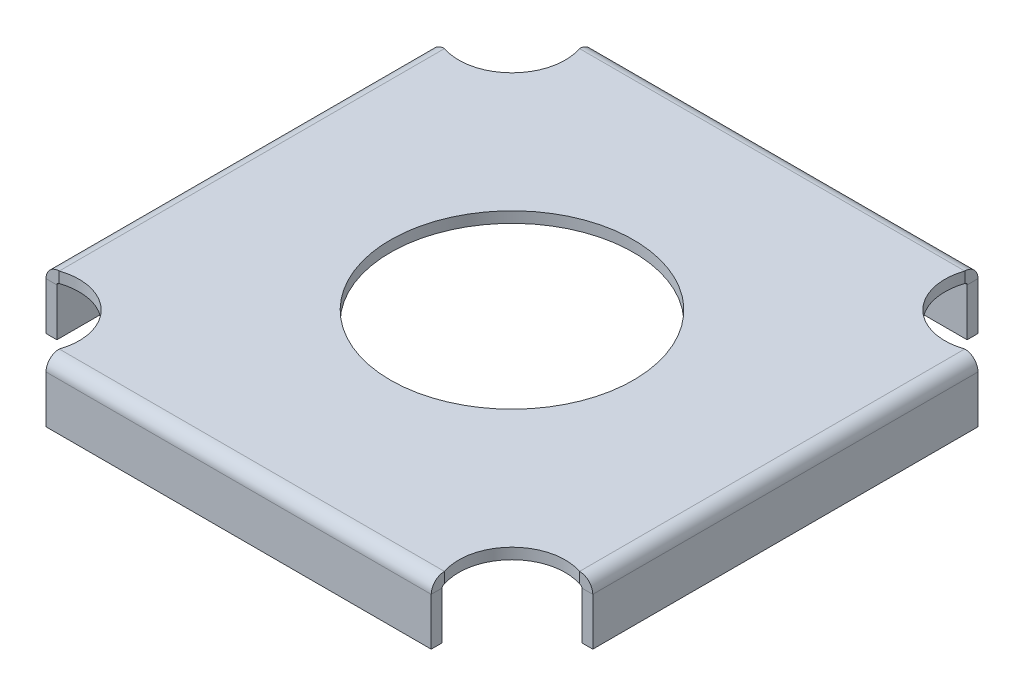
ISO-10303-21;
HEADER;
FILE_DESCRIPTION(('STEP AP214'),'2;1');
FILE_NAME('part.step','',(''),(''),'','','');
FILE_SCHEMA(('AUTOMOTIVE_DESIGN { 1 0 10303 214 1 1 1 1 }'));
ENDSEC;
DATA;
#1=APPLICATION_CONTEXT('core data for automotive mechanical design processes');
#2=APPLICATION_PROTOCOL_DEFINITION('international standard','automotive_design',2000,#1);
#3=PRODUCT_CONTEXT('',#1,'mechanical');
#4=PRODUCT('Part','Part','',(#3));
#5=PRODUCT_RELATED_PRODUCT_CATEGORY('part','',(#4));
#6=PRODUCT_DEFINITION_FORMATION('','',#4);
#7=PRODUCT_DEFINITION_CONTEXT('part definition',#1,'design');
#8=PRODUCT_DEFINITION('design','',#6,#7);
#9=PRODUCT_DEFINITION_SHAPE('','',#8);
#10=(LENGTH_UNIT() NAMED_UNIT(*) SI_UNIT(.MILLI.,.METRE.));
#11=(NAMED_UNIT(*) PLANE_ANGLE_UNIT() SI_UNIT($,.RADIAN.));
#12=(NAMED_UNIT(*) SI_UNIT($,.STERADIAN.) SOLID_ANGLE_UNIT());
#13=UNCERTAINTY_MEASURE_WITH_UNIT(LENGTH_MEASURE(1.E-05),#10,'distance_accuracy_value','');
#14=(GEOMETRIC_REPRESENTATION_CONTEXT(3) GLOBAL_UNCERTAINTY_ASSIGNED_CONTEXT((#13)) GLOBAL_UNIT_ASSIGNED_CONTEXT((#10,
#11,#12)) REPRESENTATION_CONTEXT('',''));
#15=CARTESIAN_POINT('',(0.,0.,0.));
#16=DIRECTION('',(0.,0.,1.));
#17=DIRECTION('',(1.,0.,0.));
#18=AXIS2_PLACEMENT_3D('',#15,#16,#17);
#19=CARTESIAN_POINT('',(76.2,-3.4163,76.2));
#20=DIRECTION('',(0.,1.,0.));
#21=DIRECTION('',(0.,0.,1.));
#22=AXIS2_PLACEMENT_3D('',#19,#20,#21);
#23=CYLINDRICAL_SURFACE('',#22,16.7005);
#24=CARTESIAN_POINT('',(76.2,0.,76.2));
#25=DIRECTION('',(0.,-1.,0.));
#26=DIRECTION('',(0.,0.,1.));
#27=AXIS2_PLACEMENT_3D('',#24,#25,#26);
#28=CIRCLE('',#27,16.7005);
#29=CARTESIAN_POINT('',(60.3828089759907,0.,81.5594));
#30=VERTEX_POINT('',#29);
#31=CARTESIAN_POINT('',(81.5594,0.,60.3828089759907));
#32=VERTEX_POINT('',#31);
#33=EDGE_CURVE('E469',#30,#32,#28,.T.);
#34=ORIENTED_EDGE('',*,*,#33,.F.);
#35=DIRECTION('',(0.,1.,0.));
#36=VECTOR('',#35,1.);
#37=CARTESIAN_POINT('',(60.3828089759907,-3.4163,81.5594));
#38=LINE('',#37,#36);
#39=CARTESIAN_POINT('',(60.3828089759907,-3.41629999999999,81.5594));
#40=VERTEX_POINT('',#39);
#41=EDGE_CURVE('E13',#40,#30,#38,.T.);
#42=ORIENTED_EDGE('',*,*,#41,.F.);
#43=CARTESIAN_POINT('',(76.2,-3.4163,76.2));
#44=DIRECTION('',(0.,-1.,0.));
#45=DIRECTION('',(0.,0.,1.));
#46=AXIS2_PLACEMENT_3D('',#43,#44,#45);
#47=CIRCLE('',#46,16.7005);
#48=CARTESIAN_POINT('',(81.5594,-3.4163,60.3828089759907));
#49=VERTEX_POINT('',#48);
#50=EDGE_CURVE('E472',#40,#49,#47,.T.);
#51=ORIENTED_EDGE('',*,*,#50,.T.);
#52=DIRECTION('',(0.,1.,0.));
#53=VECTOR('',#52,1.);
#54=CARTESIAN_POINT('',(81.5594,-3.4163,60.3828089759907));
#55=LINE('',#54,#53);
#56=EDGE_CURVE('E126',#49,#32,#55,.T.);
#57=ORIENTED_EDGE('',*,*,#56,.T.);
#58=EDGE_LOOP('',(#34,#42,#51,#57));
#59=FACE_BOUND('',#58,.T.);
#60=ADVANCED_FACE('F123',(#59),#23,.F.);
#61=CARTESIAN_POINT('',(-76.2,-3.4163,76.2));
#62=DIRECTION('',(0.,1.,0.));
#63=DIRECTION('',(0.,0.,1.));
#64=AXIS2_PLACEMENT_3D('',#61,#62,#63);
#65=CYLINDRICAL_SURFACE('',#64,16.7005);
#66=CARTESIAN_POINT('',(-76.2,0.,76.2));
#67=DIRECTION('',(0.,-1.,0.));
#68=DIRECTION('',(0.,0.,1.));
#69=AXIS2_PLACEMENT_3D('',#66,#67,#68);
#70=CIRCLE('',#69,16.7005);
#71=CARTESIAN_POINT('',(-81.5594,0.,60.3828089759907));
#72=VERTEX_POINT('',#71);
#73=CARTESIAN_POINT('',(-60.3828089759907,0.,81.5594));
#74=VERTEX_POINT('',#73);
#75=EDGE_CURVE('E510',#72,#74,#70,.T.);
#76=ORIENTED_EDGE('',*,*,#75,.F.);
#77=DIRECTION('',(0.,1.,0.));
#78=VECTOR('',#77,1.);
#79=CARTESIAN_POINT('',(-81.5594,-3.4163,60.3828089759907));
#80=LINE('',#79,#78);
#81=CARTESIAN_POINT('',(-81.5594,-3.4163,60.3828089759907));
#82=VERTEX_POINT('',#81);
#83=EDGE_CURVE('E517',#82,#72,#80,.T.);
#84=ORIENTED_EDGE('',*,*,#83,.F.);
#85=CARTESIAN_POINT('',(-76.2,-3.4163,76.2));
#86=DIRECTION('',(0.,-1.,0.));
#87=DIRECTION('',(0.,0.,1.));
#88=AXIS2_PLACEMENT_3D('',#85,#86,#87);
#89=CIRCLE('',#88,16.7005);
#90=CARTESIAN_POINT('',(-60.3828089759907,-3.41629999999999,81.5594));
#91=VERTEX_POINT('',#90);
#92=EDGE_CURVE('E488',#82,#91,#89,.T.);
#93=ORIENTED_EDGE('',*,*,#92,.T.);
#94=DIRECTION('',(0.,1.,0.));
#95=VECTOR('',#94,1.);
#96=CARTESIAN_POINT('',(-60.3828089759907,-3.4163,81.5594));
#97=LINE('',#96,#95);
#98=EDGE_CURVE('E131',#91,#74,#97,.T.);
#99=ORIENTED_EDGE('',*,*,#98,.T.);
#100=EDGE_LOOP('',(#76,#84,#93,#99));
#101=FACE_BOUND('',#100,.T.);
#102=ADVANCED_FACE('F549',(#101),#65,.F.);
#103=CARTESIAN_POINT('',(-76.2,-3.4163,-76.2));
#104=DIRECTION('',(0.,1.,0.));
#105=DIRECTION('',(0.,0.,1.));
#106=AXIS2_PLACEMENT_3D('',#103,#104,#105);
#107=CYLINDRICAL_SURFACE('',#106,16.7005);
#108=CARTESIAN_POINT('',(-76.2,0.,-76.2));
#109=DIRECTION('',(0.,-1.,0.));
#110=DIRECTION('',(0.,0.,1.));
#111=AXIS2_PLACEMENT_3D('',#108,#109,#110);
#112=CIRCLE('',#111,16.7005);
#113=CARTESIAN_POINT('',(-60.3828089759907,0.,-81.5594));
#114=VERTEX_POINT('',#113);
#115=CARTESIAN_POINT('',(-81.5594,0.,-60.3828089759907));
#116=VERTEX_POINT('',#115);
#117=EDGE_CURVE('E504',#114,#116,#112,.T.);
#118=ORIENTED_EDGE('',*,*,#117,.F.);
#119=DIRECTION('',(0.,1.,0.));
#120=VECTOR('',#119,1.);
#121=CARTESIAN_POINT('',(-60.3828089759907,-3.4163,-81.5594));
#122=LINE('',#121,#120);
#123=CARTESIAN_POINT('',(-60.3828089759907,-3.4163,-81.5594));
#124=VERTEX_POINT('',#123);
#125=EDGE_CURVE('E522',#124,#114,#122,.T.);
#126=ORIENTED_EDGE('',*,*,#125,.F.);
#127=CARTESIAN_POINT('',(-76.2,-3.4163,-76.2));
#128=DIRECTION('',(0.,-1.,0.));
#129=DIRECTION('',(0.,0.,1.));
#130=AXIS2_PLACEMENT_3D('',#127,#128,#129);
#131=CIRCLE('',#130,16.7005);
#132=CARTESIAN_POINT('',(-81.5594,-3.4163,-60.3828089759907));
#133=VERTEX_POINT('',#132);
#134=EDGE_CURVE('E483',#124,#133,#131,.T.);
#135=ORIENTED_EDGE('',*,*,#134,.T.);
#136=DIRECTION('',(0.,1.,0.));
#137=VECTOR('',#136,1.);
#138=CARTESIAN_POINT('',(-81.5594,-3.4163,-60.3828089759907));
#139=LINE('',#138,#137);
#140=EDGE_CURVE('E519',#133,#116,#139,.T.);
#141=ORIENTED_EDGE('',*,*,#140,.T.);
#142=EDGE_LOOP('',(#118,#126,#135,#141));
#143=FACE_BOUND('',#142,.T.);
#144=ADVANCED_FACE('F595',(#143),#107,.F.);
#145=CARTESIAN_POINT('',(76.2,-3.4163,-76.2));
#146=DIRECTION('',(0.,1.,0.));
#147=DIRECTION('',(0.,0.,1.));
#148=AXIS2_PLACEMENT_3D('',#145,#146,#147);
#149=CYLINDRICAL_SURFACE('',#148,16.7005);
#150=CARTESIAN_POINT('',(76.2,0.,-76.2));
#151=DIRECTION('',(0.,-1.,0.));
#152=DIRECTION('',(0.,0.,1.));
#153=AXIS2_PLACEMENT_3D('',#150,#151,#152);
#154=CIRCLE('',#153,16.7005);
#155=CARTESIAN_POINT('',(81.5594,0.,-60.3828089759907));
#156=VERTEX_POINT('',#155);
#157=CARTESIAN_POINT('',(60.3828089759907,0.,-81.5594));
#158=VERTEX_POINT('',#157);
#159=EDGE_CURVE('E498',#156,#158,#154,.T.);
#160=ORIENTED_EDGE('',*,*,#159,.F.);
#161=DIRECTION('',(0.,1.,0.));
#162=VECTOR('',#161,1.);
#163=CARTESIAN_POINT('',(81.5594,-3.4163,-60.3828089759907));
#164=LINE('',#163,#162);
#165=CARTESIAN_POINT('',(81.5594,-3.4163,-60.3828089759907));
#166=VERTEX_POINT('',#165);
#167=EDGE_CURVE('E527',#166,#156,#164,.T.);
#168=ORIENTED_EDGE('',*,*,#167,.F.);
#169=CARTESIAN_POINT('',(76.2,-3.4163,-76.2));
#170=DIRECTION('',(0.,-1.,0.));
#171=DIRECTION('',(0.,0.,1.));
#172=AXIS2_PLACEMENT_3D('',#169,#170,#171);
#173=CIRCLE('',#172,16.7005);
#174=CARTESIAN_POINT('',(60.3828089759907,-3.4163,-81.5594));
#175=VERTEX_POINT('',#174);
#176=EDGE_CURVE('E478',#166,#175,#173,.T.);
#177=ORIENTED_EDGE('',*,*,#176,.T.);
#178=DIRECTION('',(0.,1.,0.));
#179=VECTOR('',#178,1.);
#180=CARTESIAN_POINT('',(60.3828089759907,-3.4163,-81.5594));
#181=LINE('',#180,#179);
#182=EDGE_CURVE('E525',#175,#158,#181,.T.);
#183=ORIENTED_EDGE('',*,*,#182,.T.);
#184=EDGE_LOOP('',(#160,#168,#177,#183));
#185=FACE_BOUND('',#184,.T.);
#186=ADVANCED_FACE('F600',(#185),#149,.F.);
#187=CARTESIAN_POINT('',(76.2,-3.4163,76.2));
#188=DIRECTION('',(0.,1.,0.));
#189=DIRECTION('',(0.,0.,1.));
#190=AXIS2_PLACEMENT_3D('',#187,#188,#189);
#191=PLANE('',#190);
#192=CARTESIAN_POINT('',(0.,-3.4163,0.));
#193=DIRECTION('',(0.,1.,0.));
#194=DIRECTION('',(0.,0.,1.));
#195=AXIS2_PLACEMENT_3D('',#192,#193,#194);
#196=CIRCLE('',#195,38.1);
#197=CARTESIAN_POINT('',(0.,-3.4163,38.1));
#198=VERTEX_POINT('',#197);
#199=EDGE_CURVE('E466',#198,#198,#196,.T.);
#200=ORIENTED_EDGE('',*,*,#199,.T.);
#201=EDGE_LOOP('',(#200));
#202=FACE_BOUND('',#201,.T.);
#203=ORIENTED_EDGE('',*,*,#50,.F.);
#204=DIRECTION('',(1.,0.,0.));
#205=VECTOR('',#204,1.);
#206=CARTESIAN_POINT('',(60.3828089759907,-3.4163,81.5594));
#207=LINE('',#206,#205);
#208=EDGE_CURVE('E491',#91,#40,#207,.T.);
#209=ORIENTED_EDGE('',*,*,#208,.F.);
#210=ORIENTED_EDGE('',*,*,#92,.F.);
#211=DIRECTION('',(0.,0.,1.));
#212=VECTOR('',#211,1.);
#213=CARTESIAN_POINT('',(-81.5594,-3.4163,60.3828089759907));
#214=LINE('',#213,#212);
#215=EDGE_CURVE('E486',#133,#82,#214,.T.);
#216=ORIENTED_EDGE('',*,*,#215,.F.);
#217=ORIENTED_EDGE('',*,*,#134,.F.);
#218=DIRECTION('',(-1.,0.,0.));
#219=VECTOR('',#218,1.);
#220=CARTESIAN_POINT('',(-60.3828089759907,-3.4163,-81.5594));
#221=LINE('',#220,#219);
#222=EDGE_CURVE('E481',#175,#124,#221,.T.);
#223=ORIENTED_EDGE('',*,*,#222,.F.);
#224=ORIENTED_EDGE('',*,*,#176,.F.);
#225=DIRECTION('',(0.,0.,-1.));
#226=VECTOR('',#225,1.);
#227=CARTESIAN_POINT('',(81.5594,-3.4163,-60.3828089759907));
#228=LINE('',#227,#226);
#229=EDGE_CURVE('E475',#49,#166,#228,.T.);
#230=ORIENTED_EDGE('',*,*,#229,.F.);
#231=EDGE_LOOP('',(#203,#209,#210,#216,#217,#223,#224,#230));
#232=FACE_BOUND('',#231,.T.);
#233=ADVANCED_FACE('F555',(#202,#232),#191,.F.);
#234=CARTESIAN_POINT('',(76.2,0.,76.2));
#235=DIRECTION('',(0.,1.,0.));
#236=DIRECTION('',(0.,0.,1.));
#237=AXIS2_PLACEMENT_3D('',#234,#235,#236);
#238=PLANE('',#237);
#239=CARTESIAN_POINT('',(0.,0.,0.));
#240=DIRECTION('',(0.,1.,0.));
#241=DIRECTION('',(0.,0.,1.));
#242=AXIS2_PLACEMENT_3D('',#239,#240,#241);
#243=CIRCLE('',#242,38.1);
#244=CARTESIAN_POINT('',(0.,0.,38.1));
#245=VERTEX_POINT('',#244);
#246=EDGE_CURVE('E457',#245,#245,#243,.T.);
#247=ORIENTED_EDGE('',*,*,#246,.F.);
#248=EDGE_LOOP('',(#247));
#249=FACE_BOUND('',#248,.T.);
#250=ORIENTED_EDGE('',*,*,#33,.T.);
#251=DIRECTION('',(0.,0.,-1.));
#252=VECTOR('',#251,1.);
#253=CARTESIAN_POINT('',(81.5594,0.,-60.3828089759907));
#254=LINE('',#253,#252);
#255=EDGE_CURVE('E495',#32,#156,#254,.T.);
#256=ORIENTED_EDGE('',*,*,#255,.T.);
#257=ORIENTED_EDGE('',*,*,#159,.T.);
#258=DIRECTION('',(-1.,0.,0.));
#259=VECTOR('',#258,1.);
#260=CARTESIAN_POINT('',(-60.3828089759907,0.,-81.5594));
#261=LINE('',#260,#259);
#262=EDGE_CURVE('E501',#158,#114,#261,.T.);
#263=ORIENTED_EDGE('',*,*,#262,.T.);
#264=ORIENTED_EDGE('',*,*,#117,.T.);
#265=DIRECTION('',(0.,0.,1.));
#266=VECTOR('',#265,1.);
#267=CARTESIAN_POINT('',(-81.5594,0.,60.3828089759907));
#268=LINE('',#267,#266);
#269=EDGE_CURVE('E507',#116,#72,#268,.T.);
#270=ORIENTED_EDGE('',*,*,#269,.T.);
#271=ORIENTED_EDGE('',*,*,#75,.T.);
#272=DIRECTION('',(1.,0.,0.));
#273=VECTOR('',#272,1.);
#274=CARTESIAN_POINT('',(60.3828089759907,0.,81.5594));
#275=LINE('',#274,#273);
#276=EDGE_CURVE('E476',#74,#30,#275,.T.);
#277=ORIENTED_EDGE('',*,*,#276,.T.);
#278=EDGE_LOOP('',(#250,#256,#257,#263,#264,#270,#271,#277));
#279=FACE_BOUND('',#278,.T.);
#280=ADVANCED_FACE('F541',(#249,#279),#238,.T.);
#281=CARTESIAN_POINT('',(0.,-3.4163,0.));
#282=DIRECTION('',(0.,1.,0.));
#283=DIRECTION('',(0.,0.,1.));
#284=AXIS2_PLACEMENT_3D('',#281,#282,#283);
#285=CYLINDRICAL_SURFACE('',#284,38.1);
#286=ORIENTED_EDGE('',*,*,#199,.F.);
#287=EDGE_LOOP('',(#286));
#288=FACE_BOUND('',#287,.T.);
#289=ORIENTED_EDGE('',*,*,#246,.T.);
#290=EDGE_LOOP('',(#289));
#291=FACE_BOUND('',#290,.T.);
#292=ADVANCED_FACE('F714',(#288,#291),#285,.F.);
#293=CARTESIAN_POINT('',(60.3828089759907,-4.15289999999999,81.5594));
#294=DIRECTION('',(1.,0.,0.));
#295=DIRECTION('',(0.,0.,-1.));
#296=AXIS2_PLACEMENT_3D('',#293,#294,#295);
#297=PLANE('',#296);
#298=DIRECTION('',(0.,0.,1.));
#299=VECTOR('',#298,1.);
#300=CARTESIAN_POINT('',(60.3828089759907,-4.1529,85.7123));
#301=LINE('',#300,#299);
#302=CARTESIAN_POINT('',(60.3828089759907,-4.15289999999999,82.296));
#303=VERTEX_POINT('',#302);
#304=CARTESIAN_POINT('',(60.3828089759907,-4.15289999999998,85.7123));
#305=VERTEX_POINT('',#304);
#306=EDGE_CURVE('E415',#303,#305,#301,.T.);
#307=ORIENTED_EDGE('',*,*,#306,.F.);
#308=CARTESIAN_POINT('',(60.3828089759907,-4.15289999999999,81.5594));
#309=DIRECTION('',(-1.,0.,0.));
#310=DIRECTION('',(0.,0.,1.));
#311=AXIS2_PLACEMENT_3D('',#308,#309,#310);
#312=CIRCLE('',#311,0.736600000000004);
#313=EDGE_CURVE('E461',#40,#303,#312,.F.);
#314=ORIENTED_EDGE('',*,*,#313,.F.);
#315=ORIENTED_EDGE('',*,*,#41,.T.);
#316=CARTESIAN_POINT('',(60.3828089759907,-4.15289999999999,81.5594));
#317=DIRECTION('',(-1.,0.,0.));
#318=DIRECTION('',(0.,0.,1.));
#319=AXIS2_PLACEMENT_3D('',#316,#317,#318);
#320=CIRCLE('',#319,4.1529);
#321=EDGE_CURVE('E139',#30,#305,#320,.F.);
#322=ORIENTED_EDGE('',*,*,#321,.T.);
#323=EDGE_LOOP('',(#307,#314,#315,#322));
#324=FACE_BOUND('',#323,.T.);
#325=ADVANCED_FACE('F562',(#324),#297,.T.);
#326=CARTESIAN_POINT('',(-60.3828089759907,-4.15289999999999,81.5594));
#327=DIRECTION('',(1.,0.,0.));
#328=DIRECTION('',(0.,0.,-1.));
#329=AXIS2_PLACEMENT_3D('',#326,#327,#328);
#330=PLANE('',#329);
#331=CARTESIAN_POINT('',(-60.3828089759907,-4.15289999999999,81.5594));
#332=DIRECTION('',(-1.,0.,0.));
#333=DIRECTION('',(0.,0.,1.));
#334=AXIS2_PLACEMENT_3D('',#331,#332,#333);
#335=CIRCLE('',#334,0.736600000000004);
#336=CARTESIAN_POINT('',(-60.3828089759907,-4.15289999999999,82.296));
#337=VERTEX_POINT('',#336);
#338=EDGE_CURVE('E426',#337,#91,#335,.T.);
#339=ORIENTED_EDGE('',*,*,#338,.F.);
#340=DIRECTION('',(0.,0.,1.));
#341=VECTOR('',#340,1.);
#342=CARTESIAN_POINT('',(-60.3828089759907,-4.15289999999999,82.296));
#343=LINE('',#342,#341);
#344=CARTESIAN_POINT('',(-60.3828089759907,-4.15289999999999,85.7123));
#345=VERTEX_POINT('',#344);
#346=EDGE_CURVE('E449',#337,#345,#343,.T.);
#347=ORIENTED_EDGE('',*,*,#346,.T.);
#348=CARTESIAN_POINT('',(-60.3828089759907,-4.15289999999999,81.5594));
#349=DIRECTION('',(-1.,0.,0.));
#350=DIRECTION('',(0.,0.,1.));
#351=AXIS2_PLACEMENT_3D('',#348,#349,#350);
#352=CIRCLE('',#351,4.1529);
#353=EDGE_CURVE('E458',#345,#74,#352,.T.);
#354=ORIENTED_EDGE('',*,*,#353,.T.);
#355=ORIENTED_EDGE('',*,*,#98,.F.);
#356=EDGE_LOOP('',(#339,#347,#354,#355));
#357=FACE_BOUND('',#356,.T.);
#358=ADVANCED_FACE('F546',(#357),#330,.F.);
#359=CARTESIAN_POINT('',(-60.3828089759907,-4.15289999999999,81.5594));
#360=DIRECTION('',(-1.,0.,0.));
#361=DIRECTION('',(0.,0.,1.));
#362=AXIS2_PLACEMENT_3D('',#359,#360,#361);
#363=CYLINDRICAL_SURFACE('',#362,4.1529);
#364=ORIENTED_EDGE('',*,*,#276,.F.);
#365=ORIENTED_EDGE('',*,*,#353,.F.);
#366=DIRECTION('',(-1.,0.,0.));
#367=VECTOR('',#366,1.);
#368=CARTESIAN_POINT('',(0.,-4.15289999999999,85.7123));
#369=LINE('',#368,#367);
#370=EDGE_CURVE('E446',#305,#345,#369,.T.);
#371=ORIENTED_EDGE('',*,*,#370,.F.);
#372=ORIENTED_EDGE('',*,*,#321,.F.);
#373=EDGE_LOOP('',(#364,#365,#371,#372));
#374=FACE_BOUND('',#373,.T.);
#375=ADVANCED_FACE('F543',(#374),#363,.T.);
#376=CARTESIAN_POINT('',(-60.3828089759907,-4.15289999999999,81.5594));
#377=DIRECTION('',(-1.,0.,0.));
#378=DIRECTION('',(0.,0.,1.));
#379=AXIS2_PLACEMENT_3D('',#376,#377,#378);
#380=CYLINDRICAL_SURFACE('',#379,0.736600000000004);
#381=ORIENTED_EDGE('',*,*,#208,.T.);
#382=ORIENTED_EDGE('',*,*,#313,.T.);
#383=DIRECTION('',(1.,0.,0.));
#384=VECTOR('',#383,1.);
#385=CARTESIAN_POINT('',(60.3828089759907,-4.1529,82.296));
#386=LINE('',#385,#384);
#387=EDGE_CURVE('E452',#303,#337,#386,.F.);
#388=ORIENTED_EDGE('',*,*,#387,.T.);
#389=ORIENTED_EDGE('',*,*,#338,.T.);
#390=EDGE_LOOP('',(#381,#382,#388,#389));
#391=FACE_BOUND('',#390,.T.);
#392=ADVANCED_FACE('F559',(#391),#380,.F.);
#393=CARTESIAN_POINT('',(-60.3828089759907,-3.41629999999999,85.7123));
#394=DIRECTION('',(-1.,0.,0.));
#395=DIRECTION('',(0.,0.,1.));
#396=AXIS2_PLACEMENT_3D('',#393,#394,#395);
#397=PLANE('',#396);
#398=DIRECTION('',(0.,1.,0.));
#399=VECTOR('',#398,1.);
#400=CARTESIAN_POINT('',(-60.3828089759907,-3.41629999999999,85.7123));
#401=LINE('',#400,#399);
#402=CARTESIAN_POINT('',(-60.3828089759907,-19.05,85.7123));
#403=VERTEX_POINT('',#402);
#404=EDGE_CURVE('E430',#403,#345,#401,.T.);
#405=ORIENTED_EDGE('',*,*,#404,.T.);
#406=ORIENTED_EDGE('',*,*,#346,.F.);
#407=DIRECTION('',(0.,-1.,0.));
#408=VECTOR('',#407,1.);
#409=CARTESIAN_POINT('',(-60.3828089759907,2.17196961742773E-13,82.296));
#410=LINE('',#409,#408);
#411=CARTESIAN_POINT('',(-60.3828089759907,-19.05,82.296));
#412=VERTEX_POINT('',#411);
#413=EDGE_CURVE('E438',#412,#337,#410,.F.);
#414=ORIENTED_EDGE('',*,*,#413,.F.);
#415=DIRECTION('',(0.,0.,-1.));
#416=VECTOR('',#415,1.);
#417=CARTESIAN_POINT('',(-60.3828089759907,-19.05,85.7123));
#418=LINE('',#417,#416);
#419=EDGE_CURVE('E424',#403,#412,#418,.T.);
#420=ORIENTED_EDGE('',*,*,#419,.F.);
#421=EDGE_LOOP('',(#405,#406,#414,#420));
#422=FACE_BOUND('',#421,.T.);
#423=ADVANCED_FACE('F579',(#422),#397,.T.);
#424=CARTESIAN_POINT('',(60.3828089759907,-19.05,85.7123));
#425=DIRECTION('',(1.,0.,0.));
#426=DIRECTION('',(0.,0.,-1.));
#427=AXIS2_PLACEMENT_3D('',#424,#425,#426);
#428=PLANE('',#427);
#429=DIRECTION('',(0.,1.,0.));
#430=VECTOR('',#429,1.);
#431=CARTESIAN_POINT('',(60.3828089759907,2.17196961742773E-13,82.296));
#432=LINE('',#431,#430);
#433=CARTESIAN_POINT('',(60.3828089759907,-19.05,82.296));
#434=VERTEX_POINT('',#433);
#435=EDGE_CURVE('E444',#303,#434,#432,.F.);
#436=ORIENTED_EDGE('',*,*,#435,.F.);
#437=ORIENTED_EDGE('',*,*,#306,.T.);
#438=DIRECTION('',(0.,-1.,0.));
#439=VECTOR('',#438,1.);
#440=CARTESIAN_POINT('',(60.3828089759907,-19.05,85.7123));
#441=LINE('',#440,#439);
#442=CARTESIAN_POINT('',(60.3828089759907,-19.05,85.7123));
#443=VERTEX_POINT('',#442);
#444=EDGE_CURVE('E436',#305,#443,#441,.T.);
#445=ORIENTED_EDGE('',*,*,#444,.T.);
#446=DIRECTION('',(0.,0.,-1.));
#447=VECTOR('',#446,1.);
#448=CARTESIAN_POINT('',(60.3828089759907,-19.05,85.7123));
#449=LINE('',#448,#447);
#450=EDGE_CURVE('E427',#443,#434,#449,.T.);
#451=ORIENTED_EDGE('',*,*,#450,.T.);
#452=EDGE_LOOP('',(#436,#437,#445,#451));
#453=FACE_BOUND('',#452,.T.);
#454=ADVANCED_FACE('F566',(#453),#428,.T.);
#455=CARTESIAN_POINT('',(0.,2.29124909440662E-13,85.7123));
#456=DIRECTION('',(0.,0.,1.));
#457=DIRECTION('',(0.,-1.,0.));
#458=AXIS2_PLACEMENT_3D('',#455,#456,#457);
#459=PLANE('',#458);
#460=ORIENTED_EDGE('',*,*,#444,.F.);
#461=ORIENTED_EDGE('',*,*,#370,.T.);
#462=ORIENTED_EDGE('',*,*,#404,.F.);
#463=DIRECTION('',(-1.,0.,0.));
#464=VECTOR('',#463,1.);
#465=CARTESIAN_POINT('',(-60.3828089759907,-19.05,85.7123));
#466=LINE('',#465,#464);
#467=EDGE_CURVE('E433',#443,#403,#466,.T.);
#468=ORIENTED_EDGE('',*,*,#467,.F.);
#469=EDGE_LOOP('',(#460,#461,#462,#468));
#470=FACE_BOUND('',#469,.T.);
#471=ADVANCED_FACE('F570',(#470),#459,.T.);
#472=CARTESIAN_POINT('',(0.,2.17196961742773E-13,82.296));
#473=DIRECTION('',(0.,0.,1.));
#474=DIRECTION('',(0.,-1.,0.));
#475=AXIS2_PLACEMENT_3D('',#472,#473,#474);
#476=PLANE('',#475);
#477=ORIENTED_EDGE('',*,*,#387,.F.);
#478=ORIENTED_EDGE('',*,*,#435,.T.);
#479=DIRECTION('',(1.,0.,0.));
#480=VECTOR('',#479,1.);
#481=CARTESIAN_POINT('',(0.,-19.05,82.296));
#482=LINE('',#481,#480);
#483=EDGE_CURVE('E441',#434,#412,#482,.F.);
#484=ORIENTED_EDGE('',*,*,#483,.T.);
#485=ORIENTED_EDGE('',*,*,#413,.T.);
#486=EDGE_LOOP('',(#477,#478,#484,#485));
#487=FACE_BOUND('',#486,.T.);
#488=ADVANCED_FACE('F577',(#487),#476,.F.);
#489=CARTESIAN_POINT('',(-60.3828089759907,-19.05,85.7123));
#490=DIRECTION('',(0.,-1.,0.));
#491=DIRECTION('',(0.,0.,-1.));
#492=AXIS2_PLACEMENT_3D('',#489,#490,#491);
#493=PLANE('',#492);
#494=ORIENTED_EDGE('',*,*,#483,.F.);
#495=ORIENTED_EDGE('',*,*,#450,.F.);
#496=ORIENTED_EDGE('',*,*,#467,.T.);
#497=ORIENTED_EDGE('',*,*,#419,.T.);
#498=EDGE_LOOP('',(#494,#495,#496,#497));
#499=FACE_BOUND('',#498,.T.);
#500=ADVANCED_FACE('F574',(#499),#493,.T.);
#501=CARTESIAN_POINT('',(81.5594,-4.1529,-60.3828089759907));
#502=DIRECTION('',(0.,0.,-1.));
#503=DIRECTION('',(-1.,0.,0.));
#504=AXIS2_PLACEMENT_3D('',#501,#502,#503);
#505=PLANE('',#504);
#506=DIRECTION('',(1.,0.,0.));
#507=VECTOR('',#506,1.);
#508=CARTESIAN_POINT('',(85.7123,-4.15289999999999,-60.3828089759907));
#509=LINE('',#508,#507);
#510=CARTESIAN_POINT('',(82.296,-4.1529,-60.3828089759907));
#511=VERTEX_POINT('',#510);
#512=CARTESIAN_POINT('',(85.7123,-4.15289999999999,-60.3828089759907));
#513=VERTEX_POINT('',#512);
#514=EDGE_CURVE('E372',#511,#513,#509,.T.);
#515=ORIENTED_EDGE('',*,*,#514,.F.);
#516=CARTESIAN_POINT('',(81.5594,-4.1529,-60.3828089759907));
#517=DIRECTION('',(0.,0.,1.));
#518=DIRECTION('',(1.,0.,0.));
#519=AXIS2_PLACEMENT_3D('',#516,#517,#518);
#520=CIRCLE('',#519,0.736600000000004);
#521=EDGE_CURVE('E419',#166,#511,#520,.F.);
#522=ORIENTED_EDGE('',*,*,#521,.F.);
#523=ORIENTED_EDGE('',*,*,#167,.T.);
#524=CARTESIAN_POINT('',(81.5594,-4.1529,-60.3828089759907));
#525=DIRECTION('',(0.,0.,1.));
#526=DIRECTION('',(1.,0.,0.));
#527=AXIS2_PLACEMENT_3D('',#524,#525,#526);
#528=CIRCLE('',#527,4.1529);
#529=EDGE_CURVE('E412',#156,#513,#528,.F.);
#530=ORIENTED_EDGE('',*,*,#529,.T.);
#531=EDGE_LOOP('',(#515,#522,#523,#530));
#532=FACE_BOUND('',#531,.T.);
#533=ADVANCED_FACE('F697',(#532),#505,.T.);
#534=CARTESIAN_POINT('',(81.5594,-4.1529,60.3828089759907));
#535=DIRECTION('',(0.,0.,-1.));
#536=DIRECTION('',(-1.,0.,0.));
#537=AXIS2_PLACEMENT_3D('',#534,#535,#536);
#538=PLANE('',#537);
#539=CARTESIAN_POINT('',(81.5594,-4.1529,60.3828089759907));
#540=DIRECTION('',(0.,0.,1.));
#541=DIRECTION('',(1.,0.,0.));
#542=AXIS2_PLACEMENT_3D('',#539,#540,#541);
#543=CIRCLE('',#542,0.736600000000004);
#544=CARTESIAN_POINT('',(82.296,-4.1529,60.3828089759907));
#545=VERTEX_POINT('',#544);
#546=EDGE_CURVE('E383',#545,#49,#543,.T.);
#547=ORIENTED_EDGE('',*,*,#546,.F.);
#548=DIRECTION('',(1.,0.,0.));
#549=VECTOR('',#548,1.);
#550=CARTESIAN_POINT('',(82.296,-4.1529,60.3828089759907));
#551=LINE('',#550,#549);
#552=CARTESIAN_POINT('',(85.7123,-4.15289999999999,60.3828089759907));
#553=VERTEX_POINT('',#552);
#554=EDGE_CURVE('E405',#545,#553,#551,.T.);
#555=ORIENTED_EDGE('',*,*,#554,.T.);
#556=CARTESIAN_POINT('',(81.5594,-4.1529,60.3828089759907));
#557=DIRECTION('',(0.,0.,1.));
#558=DIRECTION('',(1.,0.,0.));
#559=AXIS2_PLACEMENT_3D('',#556,#557,#558);
#560=CIRCLE('',#559,4.1529);
#561=EDGE_CURVE('E416',#553,#32,#560,.T.);
#562=ORIENTED_EDGE('',*,*,#561,.T.);
#563=ORIENTED_EDGE('',*,*,#56,.F.);
#564=EDGE_LOOP('',(#547,#555,#562,#563));
#565=FACE_BOUND('',#564,.T.);
#566=ADVANCED_FACE('F692',(#565),#538,.F.);
#567=CARTESIAN_POINT('',(81.5594,-4.1529,60.3828089759907));
#568=DIRECTION('',(0.,0.,1.));
#569=DIRECTION('',(1.,0.,0.));
#570=AXIS2_PLACEMENT_3D('',#567,#568,#569);
#571=CYLINDRICAL_SURFACE('',#570,4.1529);
#572=ORIENTED_EDGE('',*,*,#255,.F.);
#573=ORIENTED_EDGE('',*,*,#561,.F.);
#574=DIRECTION('',(0.,0.,1.));
#575=VECTOR('',#574,1.);
#576=CARTESIAN_POINT('',(85.7123,-4.15289999999999,-60.3828089759907));
#577=LINE('',#576,#575);
#578=EDGE_CURVE('E403',#553,#513,#577,.F.);
#579=ORIENTED_EDGE('',*,*,#578,.T.);
#580=ORIENTED_EDGE('',*,*,#529,.F.);
#581=EDGE_LOOP('',(#572,#573,#579,#580));
#582=FACE_BOUND('',#581,.T.);
#583=ADVANCED_FACE('F689',(#582),#571,.T.);
#584=CARTESIAN_POINT('',(81.5594,-4.1529,60.3828089759907));
#585=DIRECTION('',(0.,0.,1.));
#586=DIRECTION('',(1.,0.,0.));
#587=AXIS2_PLACEMENT_3D('',#584,#585,#586);
#588=CYLINDRICAL_SURFACE('',#587,0.736600000000004);
#589=ORIENTED_EDGE('',*,*,#229,.T.);
#590=ORIENTED_EDGE('',*,*,#521,.T.);
#591=DIRECTION('',(0.,0.,1.));
#592=VECTOR('',#591,1.);
#593=CARTESIAN_POINT('',(82.296,-4.1529,-60.3828089759907));
#594=LINE('',#593,#592);
#595=EDGE_CURVE('E408',#511,#545,#594,.T.);
#596=ORIENTED_EDGE('',*,*,#595,.T.);
#597=ORIENTED_EDGE('',*,*,#546,.T.);
#598=EDGE_LOOP('',(#589,#590,#596,#597));
#599=FACE_BOUND('',#598,.T.);
#600=ADVANCED_FACE('F687',(#599),#588,.F.);
#601=CARTESIAN_POINT('',(85.7123,-3.41629999999999,-60.3828089759907));
#602=DIRECTION('',(0.,0.,-1.));
#603=DIRECTION('',(-1.,0.,0.));
#604=AXIS2_PLACEMENT_3D('',#601,#602,#603);
#605=PLANE('',#604);
#606=DIRECTION('',(0.,-1.,0.));
#607=VECTOR('',#606,1.);
#608=CARTESIAN_POINT('',(82.296,2.89595948990363E-13,-60.3828089759907));
#609=LINE('',#608,#607);
#610=CARTESIAN_POINT('',(82.2960000000001,-19.05,-60.3828089759907));
#611=VERTEX_POINT('',#610);
#612=EDGE_CURVE('E401',#511,#611,#609,.T.);
#613=ORIENTED_EDGE('',*,*,#612,.F.);
#614=ORIENTED_EDGE('',*,*,#514,.T.);
#615=DIRECTION('',(0.,1.,0.));
#616=VECTOR('',#615,1.);
#617=CARTESIAN_POINT('',(85.7123,-3.41629999999999,-60.3828089759907));
#618=LINE('',#617,#616);
#619=CARTESIAN_POINT('',(85.7123000000001,-19.05,-60.3828089759907));
#620=VERTEX_POINT('',#619);
#621=EDGE_CURVE('E393',#513,#620,#618,.F.);
#622=ORIENTED_EDGE('',*,*,#621,.T.);
#623=DIRECTION('',(-1.,0.,0.));
#624=VECTOR('',#623,1.);
#625=CARTESIAN_POINT('',(85.7123000000001,-19.05,-60.3828089759907));
#626=LINE('',#625,#624);
#627=EDGE_CURVE('E384',#620,#611,#626,.T.);
#628=ORIENTED_EDGE('',*,*,#627,.T.);
#629=EDGE_LOOP('',(#613,#614,#622,#628));
#630=FACE_BOUND('',#629,.T.);
#631=ADVANCED_FACE('F680',(#630),#605,.T.);
#632=CARTESIAN_POINT('',(85.7123000000001,-19.05,60.3828089759907));
#633=DIRECTION('',(0.,0.,1.));
#634=DIRECTION('',(0.,-1.,0.));
#635=AXIS2_PLACEMENT_3D('',#632,#633,#634);
#636=PLANE('',#635);
#637=DIRECTION('',(0.,-1.,0.));
#638=VECTOR('',#637,1.);
#639=CARTESIAN_POINT('',(85.7123000000001,-19.05,60.3828089759907));
#640=LINE('',#639,#638);
#641=CARTESIAN_POINT('',(85.7123000000001,-19.05,60.3828089759907));
#642=VERTEX_POINT('',#641);
#643=EDGE_CURVE('E387',#642,#553,#640,.F.);
#644=ORIENTED_EDGE('',*,*,#643,.T.);
#645=ORIENTED_EDGE('',*,*,#554,.F.);
#646=DIRECTION('',(0.,1.,0.));
#647=VECTOR('',#646,1.);
#648=CARTESIAN_POINT('',(82.296,3.16396380436809E-13,60.3828089759907));
#649=LINE('',#648,#647);
#650=CARTESIAN_POINT('',(82.2960000000001,-19.05,60.3828089759907));
#651=VERTEX_POINT('',#650);
#652=EDGE_CURVE('E395',#651,#545,#649,.T.);
#653=ORIENTED_EDGE('',*,*,#652,.F.);
#654=DIRECTION('',(-1.,0.,0.));
#655=VECTOR('',#654,1.);
#656=CARTESIAN_POINT('',(85.7123000000001,-19.05,60.3828089759907));
#657=LINE('',#656,#655);
#658=EDGE_CURVE('E381',#642,#651,#657,.T.);
#659=ORIENTED_EDGE('',*,*,#658,.F.);
#660=EDGE_LOOP('',(#644,#645,#653,#659));
#661=FACE_BOUND('',#660,.T.);
#662=ADVANCED_FACE('F673',(#661),#636,.T.);
#663=CARTESIAN_POINT('',(85.7123,3.01523896688253E-13,0.));
#664=DIRECTION('',(-1.,0.,0.));
#665=DIRECTION('',(0.,-1.,0.));
#666=AXIS2_PLACEMENT_3D('',#663,#664,#665);
#667=PLANE('',#666);
#668=ORIENTED_EDGE('',*,*,#578,.F.);
#669=ORIENTED_EDGE('',*,*,#643,.F.);
#670=DIRECTION('',(0.,0.,-1.));
#671=VECTOR('',#670,1.);
#672=CARTESIAN_POINT('',(85.7123000000001,-19.05,-60.3828089759907));
#673=LINE('',#672,#671);
#674=EDGE_CURVE('E390',#620,#642,#673,.F.);
#675=ORIENTED_EDGE('',*,*,#674,.F.);
#676=ORIENTED_EDGE('',*,*,#621,.F.);
#677=EDGE_LOOP('',(#668,#669,#675,#676));
#678=FACE_BOUND('',#677,.T.);
#679=ADVANCED_FACE('F669',(#678),#667,.F.);
#680=CARTESIAN_POINT('',(82.296,2.89595948990363E-13,0.));
#681=DIRECTION('',(-1.,0.,0.));
#682=DIRECTION('',(0.,-1.,0.));
#683=AXIS2_PLACEMENT_3D('',#680,#681,#682);
#684=PLANE('',#683);
#685=ORIENTED_EDGE('',*,*,#652,.T.);
#686=ORIENTED_EDGE('',*,*,#595,.F.);
#687=ORIENTED_EDGE('',*,*,#612,.T.);
#688=DIRECTION('',(0.,0.,1.));
#689=VECTOR('',#688,1.);
#690=CARTESIAN_POINT('',(82.2960000000001,-19.05,0.));
#691=LINE('',#690,#689);
#692=EDGE_CURVE('E398',#611,#651,#691,.T.);
#693=ORIENTED_EDGE('',*,*,#692,.T.);
#694=EDGE_LOOP('',(#685,#686,#687,#693));
#695=FACE_BOUND('',#694,.T.);
#696=ADVANCED_FACE('F672',(#695),#684,.T.);
#697=CARTESIAN_POINT('',(85.7123000000001,-19.05,-60.3828089759907));
#698=DIRECTION('',(0.,-1.,0.));
#699=DIRECTION('',(1.,0.,0.));
#700=AXIS2_PLACEMENT_3D('',#697,#698,#699);
#701=PLANE('',#700);
#702=ORIENTED_EDGE('',*,*,#692,.F.);
#703=ORIENTED_EDGE('',*,*,#627,.F.);
#704=ORIENTED_EDGE('',*,*,#674,.T.);
#705=ORIENTED_EDGE('',*,*,#658,.T.);
#706=EDGE_LOOP('',(#702,#703,#704,#705));
#707=FACE_BOUND('',#706,.T.);
#708=ADVANCED_FACE('F666',(#707),#701,.T.);
#709=CARTESIAN_POINT('',(-60.3828089759907,-4.1529,-81.5594));
#710=DIRECTION('',(-1.,0.,0.));
#711=DIRECTION('',(0.,0.,1.));
#712=AXIS2_PLACEMENT_3D('',#709,#710,#711);
#713=PLANE('',#712);
#714=DIRECTION('',(0.,0.,-1.));
#715=VECTOR('',#714,1.);
#716=CARTESIAN_POINT('',(-60.3828089759907,-4.15289999999998,-85.7123));
#717=LINE('',#716,#715);
#718=CARTESIAN_POINT('',(-60.3828089759907,-4.1529,-82.296));
#719=VERTEX_POINT('',#718);
#720=CARTESIAN_POINT('',(-60.3828089759907,-4.15289999999998,-85.7123));
#721=VERTEX_POINT('',#720);
#722=EDGE_CURVE('E329',#719,#721,#717,.T.);
#723=ORIENTED_EDGE('',*,*,#722,.F.);
#724=CARTESIAN_POINT('',(-60.3828089759907,-4.1529,-81.5594));
#725=DIRECTION('',(1.,0.,0.));
#726=DIRECTION('',(0.,0.,-1.));
#727=AXIS2_PLACEMENT_3D('',#724,#725,#726);
#728=CIRCLE('',#727,0.736600000000004);
#729=EDGE_CURVE('E376',#124,#719,#728,.F.);
#730=ORIENTED_EDGE('',*,*,#729,.F.);
#731=ORIENTED_EDGE('',*,*,#125,.T.);
#732=CARTESIAN_POINT('',(-60.3828089759907,-4.1529,-81.5594));
#733=DIRECTION('',(1.,0.,0.));
#734=DIRECTION('',(0.,0.,-1.));
#735=AXIS2_PLACEMENT_3D('',#732,#733,#734);
#736=CIRCLE('',#735,4.1529);
#737=EDGE_CURVE('E369',#114,#721,#736,.F.);
#738=ORIENTED_EDGE('',*,*,#737,.T.);
#739=EDGE_LOOP('',(#723,#730,#731,#738));
#740=FACE_BOUND('',#739,.T.);
#741=ADVANCED_FACE('F637',(#740),#713,.T.);
#742=CARTESIAN_POINT('',(60.3828089759907,-4.1529,-81.5594));
#743=DIRECTION('',(-1.,0.,0.));
#744=DIRECTION('',(0.,0.,1.));
#745=AXIS2_PLACEMENT_3D('',#742,#743,#744);
#746=PLANE('',#745);
#747=CARTESIAN_POINT('',(60.3828089759907,-4.1529,-81.5594));
#748=DIRECTION('',(1.,0.,0.));
#749=DIRECTION('',(0.,0.,-1.));
#750=AXIS2_PLACEMENT_3D('',#747,#748,#749);
#751=CIRCLE('',#750,0.736600000000004);
#752=CARTESIAN_POINT('',(60.3828089759907,-4.1529,-82.296));
#753=VERTEX_POINT('',#752);
#754=EDGE_CURVE('E340',#753,#175,#751,.T.);
#755=ORIENTED_EDGE('',*,*,#754,.F.);
#756=DIRECTION('',(0.,0.,-1.));
#757=VECTOR('',#756,1.);
#758=CARTESIAN_POINT('',(60.3828089759907,-4.15289999999999,-82.296));
#759=LINE('',#758,#757);
#760=CARTESIAN_POINT('',(60.3828089759907,-4.15289999999996,-85.7123));
#761=VERTEX_POINT('',#760);
#762=EDGE_CURVE('E362',#753,#761,#759,.T.);
#763=ORIENTED_EDGE('',*,*,#762,.T.);
#764=CARTESIAN_POINT('',(60.3828089759907,-4.1529,-81.5594));
#765=DIRECTION('',(1.,0.,0.));
#766=DIRECTION('',(0.,0.,-1.));
#767=AXIS2_PLACEMENT_3D('',#764,#765,#766);
#768=CIRCLE('',#767,4.1529);
#769=EDGE_CURVE('E373',#761,#158,#768,.T.);
#770=ORIENTED_EDGE('',*,*,#769,.T.);
#771=ORIENTED_EDGE('',*,*,#182,.F.);
#772=EDGE_LOOP('',(#755,#763,#770,#771));
#773=FACE_BOUND('',#772,.T.);
#774=ADVANCED_FACE('F617',(#773),#746,.F.);
#775=CARTESIAN_POINT('',(60.3828089759907,-4.1529,-81.5594));
#776=DIRECTION('',(1.,0.,0.));
#777=DIRECTION('',(0.,0.,-1.));
#778=AXIS2_PLACEMENT_3D('',#775,#776,#777);
#779=CYLINDRICAL_SURFACE('',#778,4.1529);
#780=ORIENTED_EDGE('',*,*,#262,.F.);
#781=ORIENTED_EDGE('',*,*,#769,.F.);
#782=DIRECTION('',(1.,0.,0.));
#783=VECTOR('',#782,1.);
#784=CARTESIAN_POINT('',(-60.3828089759907,-4.15289999999998,-85.7123));
#785=LINE('',#784,#783);
#786=EDGE_CURVE('E360',#761,#721,#785,.F.);
#787=ORIENTED_EDGE('',*,*,#786,.T.);
#788=ORIENTED_EDGE('',*,*,#737,.F.);
#789=EDGE_LOOP('',(#780,#781,#787,#788));
#790=FACE_BOUND('',#789,.T.);
#791=ADVANCED_FACE('F614',(#790),#779,.T.);
#792=CARTESIAN_POINT('',(60.3828089759907,-4.1529,-81.5594));
#793=DIRECTION('',(1.,0.,0.));
#794=DIRECTION('',(0.,0.,-1.));
#795=AXIS2_PLACEMENT_3D('',#792,#793,#794);
#796=CYLINDRICAL_SURFACE('',#795,0.736600000000004);
#797=ORIENTED_EDGE('',*,*,#222,.T.);
#798=ORIENTED_EDGE('',*,*,#729,.T.);
#799=DIRECTION('',(1.,0.,0.));
#800=VECTOR('',#799,1.);
#801=CARTESIAN_POINT('',(-60.3828089759907,-4.1529,-82.296));
#802=LINE('',#801,#800);
#803=EDGE_CURVE('E365',#719,#753,#802,.T.);
#804=ORIENTED_EDGE('',*,*,#803,.T.);
#805=ORIENTED_EDGE('',*,*,#754,.T.);
#806=EDGE_LOOP('',(#797,#798,#804,#805));
#807=FACE_BOUND('',#806,.T.);
#808=ADVANCED_FACE('F641',(#807),#796,.F.);
#809=CARTESIAN_POINT('',(-60.3828089759907,-3.41629999999999,-85.7123));
#810=DIRECTION('',(-1.,0.,0.));
#811=DIRECTION('',(0.,0.,1.));
#812=AXIS2_PLACEMENT_3D('',#809,#810,#811);
#813=PLANE('',#812);
#814=DIRECTION('',(0.,-1.,0.));
#815=VECTOR('',#814,1.);
#816=CARTESIAN_POINT('',(-60.3828089759907,2.89595948990363E-13,-82.296));
#817=LINE('',#816,#815);
#818=CARTESIAN_POINT('',(-60.3828089759907,-19.05,-82.296));
#819=VERTEX_POINT('',#818);
#820=EDGE_CURVE('E358',#719,#819,#817,.T.);
#821=ORIENTED_EDGE('',*,*,#820,.F.);
#822=ORIENTED_EDGE('',*,*,#722,.T.);
#823=DIRECTION('',(0.,1.,0.));
#824=VECTOR('',#823,1.);
#825=CARTESIAN_POINT('',(-60.3828089759907,-3.41629999999999,-85.7123));
#826=LINE('',#825,#824);
#827=CARTESIAN_POINT('',(-60.3828089759907,-19.05,-85.7123));
#828=VERTEX_POINT('',#827);
#829=EDGE_CURVE('E350',#721,#828,#826,.F.);
#830=ORIENTED_EDGE('',*,*,#829,.T.);
#831=DIRECTION('',(0.,0.,1.));
#832=VECTOR('',#831,1.);
#833=CARTESIAN_POINT('',(-60.3828089759907,-19.05,-85.7123));
#834=LINE('',#833,#832);
#835=EDGE_CURVE('E341',#828,#819,#834,.T.);
#836=ORIENTED_EDGE('',*,*,#835,.T.);
#837=EDGE_LOOP('',(#821,#822,#830,#836));
#838=FACE_BOUND('',#837,.T.);
#839=ADVANCED_FACE('F634',(#838),#813,.T.);
#840=CARTESIAN_POINT('',(60.3828089759907,-19.05,-85.7123));
#841=DIRECTION('',(1.,0.,0.));
#842=DIRECTION('',(0.,1.,0.));
#843=AXIS2_PLACEMENT_3D('',#840,#841,#842);
#844=PLANE('',#843);
#845=DIRECTION('',(0.,-1.,0.));
#846=VECTOR('',#845,1.);
#847=CARTESIAN_POINT('',(60.3828089759907,-19.05,-85.7123));
#848=LINE('',#847,#846);
#849=CARTESIAN_POINT('',(60.3828089759907,-19.05,-85.7123));
#850=VERTEX_POINT('',#849);
#851=EDGE_CURVE('E344',#850,#761,#848,.F.);
#852=ORIENTED_EDGE('',*,*,#851,.T.);
#853=ORIENTED_EDGE('',*,*,#762,.F.);
#854=DIRECTION('',(0.,1.,0.));
#855=VECTOR('',#854,1.);
#856=CARTESIAN_POINT('',(60.3828089759907,3.16396380436809E-13,-82.296));
#857=LINE('',#856,#855);
#858=CARTESIAN_POINT('',(60.3828089759907,-19.05,-82.296));
#859=VERTEX_POINT('',#858);
#860=EDGE_CURVE('E352',#859,#753,#857,.T.);
#861=ORIENTED_EDGE('',*,*,#860,.F.);
#862=DIRECTION('',(0.,0.,1.));
#863=VECTOR('',#862,1.);
#864=CARTESIAN_POINT('',(60.3828089759907,-19.05,-85.7123));
#865=LINE('',#864,#863);
#866=EDGE_CURVE('E338',#850,#859,#865,.T.);
#867=ORIENTED_EDGE('',*,*,#866,.F.);
#868=EDGE_LOOP('',(#852,#853,#861,#867));
#869=FACE_BOUND('',#868,.T.);
#870=ADVANCED_FACE('F627',(#869),#844,.T.);
#871=CARTESIAN_POINT('',(0.,3.01523896688253E-13,-85.7123));
#872=DIRECTION('',(0.,0.,1.));
#873=DIRECTION('',(0.,-1.,0.));
#874=AXIS2_PLACEMENT_3D('',#871,#872,#873);
#875=PLANE('',#874);
#876=ORIENTED_EDGE('',*,*,#786,.F.);
#877=ORIENTED_EDGE('',*,*,#851,.F.);
#878=DIRECTION('',(-1.,0.,0.));
#879=VECTOR('',#878,1.);
#880=CARTESIAN_POINT('',(-60.3828089759907,-19.05,-85.7123));
#881=LINE('',#880,#879);
#882=EDGE_CURVE('E347',#828,#850,#881,.F.);
#883=ORIENTED_EDGE('',*,*,#882,.F.);
#884=ORIENTED_EDGE('',*,*,#829,.F.);
#885=EDGE_LOOP('',(#876,#877,#883,#884));
#886=FACE_BOUND('',#885,.T.);
#887=ADVANCED_FACE('F625',(#886),#875,.F.);
#888=CARTESIAN_POINT('',(0.,2.89595948990363E-13,-82.296));
#889=DIRECTION('',(0.,0.,1.));
#890=DIRECTION('',(0.,-1.,0.));
#891=AXIS2_PLACEMENT_3D('',#888,#889,#890);
#892=PLANE('',#891);
#893=ORIENTED_EDGE('',*,*,#860,.T.);
#894=ORIENTED_EDGE('',*,*,#803,.F.);
#895=ORIENTED_EDGE('',*,*,#820,.T.);
#896=DIRECTION('',(1.,0.,0.));
#897=VECTOR('',#896,1.);
#898=CARTESIAN_POINT('',(0.,-19.05,-82.296));
#899=LINE('',#898,#897);
#900=EDGE_CURVE('E355',#819,#859,#899,.T.);
#901=ORIENTED_EDGE('',*,*,#900,.T.);
#902=EDGE_LOOP('',(#893,#894,#895,#901));
#903=FACE_BOUND('',#902,.T.);
#904=ADVANCED_FACE('F644',(#903),#892,.T.);
#905=CARTESIAN_POINT('',(-60.3828089759907,-19.05,-85.7123));
#906=DIRECTION('',(0.,-1.,0.));
#907=DIRECTION('',(0.,0.,-1.));
#908=AXIS2_PLACEMENT_3D('',#905,#906,#907);
#909=PLANE('',#908);
#910=ORIENTED_EDGE('',*,*,#900,.F.);
#911=ORIENTED_EDGE('',*,*,#835,.F.);
#912=ORIENTED_EDGE('',*,*,#882,.T.);
#913=ORIENTED_EDGE('',*,*,#866,.T.);
#914=EDGE_LOOP('',(#910,#911,#912,#913));
#915=FACE_BOUND('',#914,.T.);
#916=ADVANCED_FACE('F630',(#915),#909,.T.);
#917=CARTESIAN_POINT('',(-81.5594,-4.1529,60.3828089759907));
#918=DIRECTION('',(0.,0.,1.));
#919=DIRECTION('',(1.,0.,0.));
#920=AXIS2_PLACEMENT_3D('',#917,#918,#919);
#921=PLANE('',#920);
#922=DIRECTION('',(-1.,0.,0.));
#923=VECTOR('',#922,1.);
#924=CARTESIAN_POINT('',(-85.7123,-4.15289999999999,60.3828089759907));
#925=LINE('',#924,#923);
#926=CARTESIAN_POINT('',(-82.296,-4.1529,60.3828089759907));
#927=VERTEX_POINT('',#926);
#928=CARTESIAN_POINT('',(-85.7123,-4.15289999999999,60.3828089759907));
#929=VERTEX_POINT('',#928);
#930=EDGE_CURVE('E325',#927,#929,#925,.T.);
#931=ORIENTED_EDGE('',*,*,#930,.F.);
#932=CARTESIAN_POINT('',(-81.5594,-4.1529,60.3828089759907));
#933=DIRECTION('',(0.,0.,-1.));
#934=DIRECTION('',(-1.,0.,0.));
#935=AXIS2_PLACEMENT_3D('',#932,#933,#934);
#936=CIRCLE('',#935,0.736600000000004);
#937=EDGE_CURVE('E333',#82,#927,#936,.F.);
#938=ORIENTED_EDGE('',*,*,#937,.F.);
#939=ORIENTED_EDGE('',*,*,#83,.T.);
#940=CARTESIAN_POINT('',(-81.5594,-4.1529,60.3828089759907));
#941=DIRECTION('',(0.,0.,-1.));
#942=DIRECTION('',(-1.,0.,0.));
#943=AXIS2_PLACEMENT_3D('',#940,#941,#942);
#944=CIRCLE('',#943,4.1529);
#945=EDGE_CURVE('E146',#72,#929,#944,.F.);
#946=ORIENTED_EDGE('',*,*,#945,.T.);
#947=EDGE_LOOP('',(#931,#938,#939,#946));
#948=FACE_BOUND('',#947,.T.);
#949=ADVANCED_FACE('F651',(#948),#921,.T.);
#950=CARTESIAN_POINT('',(-81.5594,-4.1529,-60.3828089759907));
#951=DIRECTION('',(0.,0.,1.));
#952=DIRECTION('',(1.,0.,0.));
#953=AXIS2_PLACEMENT_3D('',#950,#951,#952);
#954=PLANE('',#953);
#955=CARTESIAN_POINT('',(-81.5594,-4.1529,-60.3828089759907));
#956=DIRECTION('',(0.,0.,-1.));
#957=DIRECTION('',(-1.,0.,0.));
#958=AXIS2_PLACEMENT_3D('',#955,#956,#957);
#959=CIRCLE('',#958,0.736600000000004);
#960=CARTESIAN_POINT('',(-82.296,-4.1529,-60.3828089759907));
#961=VERTEX_POINT('',#960);
#962=EDGE_CURVE('E295',#961,#133,#959,.T.);
#963=ORIENTED_EDGE('',*,*,#962,.F.);
#964=DIRECTION('',(-1.,0.,0.));
#965=VECTOR('',#964,1.);
#966=CARTESIAN_POINT('',(-82.296,-4.1529,-60.3828089759907));
#967=LINE('',#966,#965);
#968=CARTESIAN_POINT('',(-85.7123,-4.15289999999999,-60.3828089759907));
#969=VERTEX_POINT('',#968);
#970=EDGE_CURVE('E320',#961,#969,#967,.T.);
#971=ORIENTED_EDGE('',*,*,#970,.T.);
#972=CARTESIAN_POINT('',(-81.5594,-4.1529,-60.3828089759907));
#973=DIRECTION('',(0.,0.,-1.));
#974=DIRECTION('',(-1.,0.,0.));
#975=AXIS2_PLACEMENT_3D('',#972,#973,#974);
#976=CIRCLE('',#975,4.1529);
#977=EDGE_CURVE('E330',#969,#116,#976,.T.);
#978=ORIENTED_EDGE('',*,*,#977,.T.);
#979=ORIENTED_EDGE('',*,*,#140,.F.);
#980=EDGE_LOOP('',(#963,#971,#978,#979));
#981=FACE_BOUND('',#980,.T.);
#982=ADVANCED_FACE('F889',(#981),#954,.F.);
#983=CARTESIAN_POINT('',(-81.5594,-4.1529,-60.3828089759907));
#984=DIRECTION('',(0.,0.,-1.));
#985=DIRECTION('',(-1.,0.,0.));
#986=AXIS2_PLACEMENT_3D('',#983,#984,#985);
#987=CYLINDRICAL_SURFACE('',#986,4.1529);
#988=ORIENTED_EDGE('',*,*,#269,.F.);
#989=ORIENTED_EDGE('',*,*,#977,.F.);
#990=DIRECTION('',(0.,0.,-1.));
#991=VECTOR('',#990,1.);
#992=CARTESIAN_POINT('',(-85.7123,-4.15289999999999,60.3828089759907));
#993=LINE('',#992,#991);
#994=EDGE_CURVE('E304',#969,#929,#993,.F.);
#995=ORIENTED_EDGE('',*,*,#994,.T.);
#996=ORIENTED_EDGE('',*,*,#945,.F.);
#997=EDGE_LOOP('',(#988,#989,#995,#996));
#998=FACE_BOUND('',#997,.T.);
#999=ADVANCED_FACE('F899',(#998),#987,.T.);
#1000=CARTESIAN_POINT('',(-81.5594,-4.1529,-60.3828089759907));
#1001=DIRECTION('',(0.,0.,-1.));
#1002=DIRECTION('',(-1.,0.,0.));
#1003=AXIS2_PLACEMENT_3D('',#1000,#1001,#1002);
#1004=CYLINDRICAL_SURFACE('',#1003,0.736600000000004);
#1005=ORIENTED_EDGE('',*,*,#215,.T.);
#1006=ORIENTED_EDGE('',*,*,#937,.T.);
#1007=DIRECTION('',(0.,0.,-1.));
#1008=VECTOR('',#1007,1.);
#1009=CARTESIAN_POINT('',(-82.296,-4.1529,60.3828089759907));
#1010=LINE('',#1009,#1008);
#1011=EDGE_CURVE('E323',#927,#961,#1010,.T.);
#1012=ORIENTED_EDGE('',*,*,#1011,.T.);
#1013=ORIENTED_EDGE('',*,*,#962,.T.);
#1014=EDGE_LOOP('',(#1005,#1006,#1012,#1013));
#1015=FACE_BOUND('',#1014,.T.);
#1016=ADVANCED_FACE('F908',(#1015),#1004,.F.);
#1017=CARTESIAN_POINT('',(-85.7123,-3.41629999999999,60.3828089759907));
#1018=DIRECTION('',(0.,0.,1.));
#1019=DIRECTION('',(1.,0.,0.));
#1020=AXIS2_PLACEMENT_3D('',#1017,#1018,#1019);
#1021=PLANE('',#1020);
#1022=DIRECTION('',(0.,-1.,0.));
#1023=VECTOR('',#1022,1.);
#1024=CARTESIAN_POINT('',(-82.296,2.89595948990363E-13,60.3828089759907));
#1025=LINE('',#1024,#1023);
#1026=CARTESIAN_POINT('',(-82.296,-19.05,60.3828089759907));
#1027=VERTEX_POINT('',#1026);
#1028=EDGE_CURVE('E317',#927,#1027,#1025,.T.);
#1029=ORIENTED_EDGE('',*,*,#1028,.F.);
#1030=ORIENTED_EDGE('',*,*,#930,.T.);
#1031=DIRECTION('',(0.,1.,0.));
#1032=VECTOR('',#1031,1.);
#1033=CARTESIAN_POINT('',(-85.7123,-3.41629999999999,60.3828089759907));
#1034=LINE('',#1033,#1032);
#1035=CARTESIAN_POINT('',(-85.7123,-19.05,60.3828089759907));
#1036=VERTEX_POINT('',#1035);
#1037=EDGE_CURVE('E309',#929,#1036,#1034,.F.);
#1038=ORIENTED_EDGE('',*,*,#1037,.T.);
#1039=DIRECTION('',(1.,0.,0.));
#1040=VECTOR('',#1039,1.);
#1041=CARTESIAN_POINT('',(-85.7123,-19.05,60.3828089759907));
#1042=LINE('',#1041,#1040);
#1043=EDGE_CURVE('E296',#1036,#1027,#1042,.T.);
#1044=ORIENTED_EDGE('',*,*,#1043,.T.);
#1045=EDGE_LOOP('',(#1029,#1030,#1038,#1044));
#1046=FACE_BOUND('',#1045,.T.);
#1047=ADVANCED_FACE('F917',(#1046),#1021,.T.);
#1048=CARTESIAN_POINT('',(-85.7123,-19.05,-60.3828089759907));
#1049=DIRECTION('',(0.,0.,-1.));
#1050=DIRECTION('',(0.,1.,0.));
#1051=AXIS2_PLACEMENT_3D('',#1048,#1049,#1050);
#1052=PLANE('',#1051);
#1053=DIRECTION('',(0.,-1.,0.));
#1054=VECTOR('',#1053,1.);
#1055=CARTESIAN_POINT('',(-85.7123,-19.05,-60.3828089759907));
#1056=LINE('',#1055,#1054);
#1057=CARTESIAN_POINT('',(-85.7123,-19.05,-60.3828089759907));
#1058=VERTEX_POINT('',#1057);
#1059=EDGE_CURVE('E288',#1058,#969,#1056,.F.);
#1060=ORIENTED_EDGE('',*,*,#1059,.T.);
#1061=ORIENTED_EDGE('',*,*,#970,.F.);
#1062=DIRECTION('',(0.,1.,0.));
#1063=VECTOR('',#1062,1.);
#1064=CARTESIAN_POINT('',(-82.296,2.62795517543918E-13,-60.3828089759907));
#1065=LINE('',#1064,#1063);
#1066=CARTESIAN_POINT('',(-82.296,-19.05,-60.3828089759907));
#1067=VERTEX_POINT('',#1066);
#1068=EDGE_CURVE('E290',#1067,#961,#1065,.T.);
#1069=ORIENTED_EDGE('',*,*,#1068,.F.);
#1070=DIRECTION('',(1.,0.,0.));
#1071=VECTOR('',#1070,1.);
#1072=CARTESIAN_POINT('',(-85.7123,-19.05,-60.3828089759907));
#1073=LINE('',#1072,#1071);
#1074=EDGE_CURVE('E284',#1058,#1067,#1073,.T.);
#1075=ORIENTED_EDGE('',*,*,#1074,.F.);
#1076=EDGE_LOOP('',(#1060,#1061,#1069,#1075));
#1077=FACE_BOUND('',#1076,.T.);
#1078=ADVANCED_FACE('F286',(#1077),#1052,.T.);
#1079=CARTESIAN_POINT('',(-85.7123,3.01523896688253E-13,0.));
#1080=DIRECTION('',(1.,0.,0.));
#1081=DIRECTION('',(0.,1.,0.));
#1082=AXIS2_PLACEMENT_3D('',#1079,#1080,#1081);
#1083=PLANE('',#1082);
#1084=ORIENTED_EDGE('',*,*,#994,.F.);
#1085=ORIENTED_EDGE('',*,*,#1059,.F.);
#1086=DIRECTION('',(0.,0.,1.));
#1087=VECTOR('',#1086,1.);
#1088=CARTESIAN_POINT('',(-85.7123,-19.05,60.3828089759907));
#1089=LINE('',#1088,#1087);
#1090=EDGE_CURVE('E303',#1036,#1058,#1089,.F.);
#1091=ORIENTED_EDGE('',*,*,#1090,.F.);
#1092=ORIENTED_EDGE('',*,*,#1037,.F.);
#1093=EDGE_LOOP('',(#1084,#1085,#1091,#1092));
#1094=FACE_BOUND('',#1093,.T.);
#1095=ADVANCED_FACE('F301',(#1094),#1083,.F.);
#1096=CARTESIAN_POINT('',(-82.296,2.89595948990363E-13,0.));
#1097=DIRECTION('',(1.,0.,0.));
#1098=DIRECTION('',(0.,1.,0.));
#1099=AXIS2_PLACEMENT_3D('',#1096,#1097,#1098);
#1100=PLANE('',#1099);
#1101=ORIENTED_EDGE('',*,*,#1068,.T.);
#1102=ORIENTED_EDGE('',*,*,#1011,.F.);
#1103=ORIENTED_EDGE('',*,*,#1028,.T.);
#1104=DIRECTION('',(0.,0.,-1.));
#1105=VECTOR('',#1104,1.);
#1106=CARTESIAN_POINT('',(-82.296,-19.05,0.));
#1107=LINE('',#1106,#1105);
#1108=EDGE_CURVE('E315',#1027,#1067,#1107,.T.);
#1109=ORIENTED_EDGE('',*,*,#1108,.T.);
#1110=EDGE_LOOP('',(#1101,#1102,#1103,#1109));
#1111=FACE_BOUND('',#1110,.T.);
#1112=ADVANCED_FACE('F944',(#1111),#1100,.T.);
#1113=CARTESIAN_POINT('',(-85.7123,-19.05,60.3828089759907));
#1114=DIRECTION('',(0.,-1.,0.));
#1115=DIRECTION('',(1.,0.,0.));
#1116=AXIS2_PLACEMENT_3D('',#1113,#1114,#1115);
#1117=PLANE('',#1116);
#1118=ORIENTED_EDGE('',*,*,#1108,.F.);
#1119=ORIENTED_EDGE('',*,*,#1043,.F.);
#1120=ORIENTED_EDGE('',*,*,#1090,.T.);
#1121=ORIENTED_EDGE('',*,*,#1074,.T.);
#1122=EDGE_LOOP('',(#1118,#1119,#1120,#1121));
#1123=FACE_BOUND('',#1122,.T.);
#1124=ADVANCED_FACE('F307',(#1123),#1117,.T.);
#1125=CLOSED_SHELL('',(#60,#102,#144,#186,#233,#280,#292,#325,#358,#375,#392,#423,#454,#471,
#488,#500,#533,#566,#583,#600,#631,#662,#679,#696,#708,#741,#774,#791,#808,#839,#870,#887,#904,
#916,#949,#982,#999,#1016,#1047,#1078,#1095,#1112,#1124));
#1126=MANIFOLD_SOLID_BREP('B2',#1125);
#1127=ADVANCED_BREP_SHAPE_REPRESENTATION('',(#18,#1126),#14);
#1128=SHAPE_DEFINITION_REPRESENTATION(#9,#1127);
ENDSEC;
END-ISO-10303-21;
